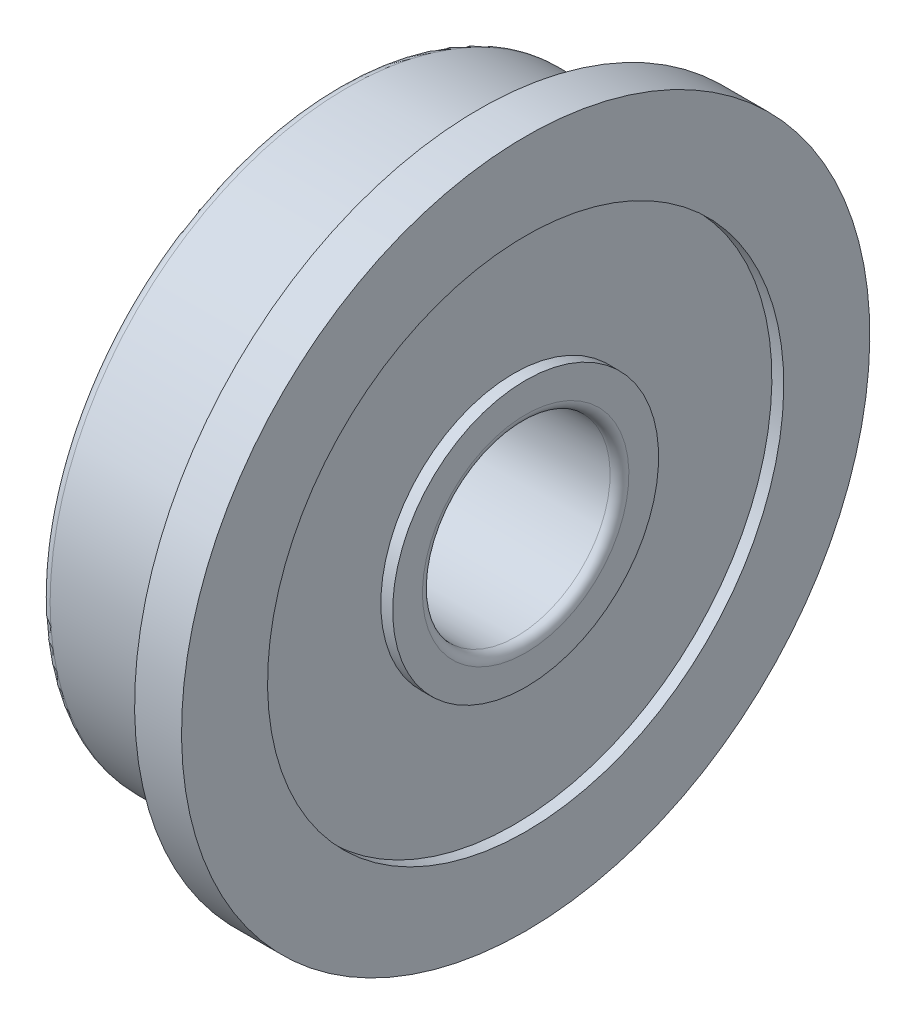
ISO-10303-21;
HEADER;
FILE_DESCRIPTION(('STEP AP214'),'2;1');
FILE_NAME('part.step','',(''),(''),'','','');
FILE_SCHEMA(('AUTOMOTIVE_DESIGN { 1 0 10303 214 1 1 1 1 }'));
ENDSEC;
DATA;
#1=APPLICATION_CONTEXT('core data for automotive mechanical design processes');
#2=APPLICATION_PROTOCOL_DEFINITION('international standard','automotive_design',2000,#1);
#3=PRODUCT_CONTEXT('',#1,'mechanical');
#4=PRODUCT('Part','Part','',(#3));
#5=PRODUCT_RELATED_PRODUCT_CATEGORY('part','',(#4));
#6=PRODUCT_DEFINITION_FORMATION('','',#4);
#7=PRODUCT_DEFINITION_CONTEXT('part definition',#1,'design');
#8=PRODUCT_DEFINITION('design','',#6,#7);
#9=PRODUCT_DEFINITION_SHAPE('','',#8);
#10=(LENGTH_UNIT() NAMED_UNIT(*) SI_UNIT(.MILLI.,.METRE.));
#11=(NAMED_UNIT(*) PLANE_ANGLE_UNIT() SI_UNIT($,.RADIAN.));
#12=(NAMED_UNIT(*) SI_UNIT($,.STERADIAN.) SOLID_ANGLE_UNIT());
#13=UNCERTAINTY_MEASURE_WITH_UNIT(LENGTH_MEASURE(1.E-05),#10,'distance_accuracy_value','');
#14=(GEOMETRIC_REPRESENTATION_CONTEXT(3) GLOBAL_UNCERTAINTY_ASSIGNED_CONTEXT((#13)) GLOBAL_UNIT_ASSIGNED_CONTEXT((#10,
#11,#12)) REPRESENTATION_CONTEXT('',''));
#15=CARTESIAN_POINT('',(0.,0.,0.));
#16=DIRECTION('',(0.,0.,1.));
#17=DIRECTION('',(1.,0.,0.));
#18=AXIS2_PLACEMENT_3D('',#15,#16,#17);
#19=CARTESIAN_POINT('',(-4.5,0.,0.));
#20=DIRECTION('',(-1.,0.,0.));
#21=DIRECTION('',(0.,-1.,0.));
#22=AXIS2_PLACEMENT_3D('',#19,#20,#21);
#23=CYLINDRICAL_SURFACE('',#22,11.);
#24=CARTESIAN_POINT('',(0.,0.,0.));
#25=DIRECTION('',(-1.,0.,0.));
#26=DIRECTION('',(0.,-1.,0.));
#27=AXIS2_PLACEMENT_3D('',#24,#25,#26);
#28=CIRCLE('',#27,11.);
#29=CARTESIAN_POINT('',(0.,-11.,0.));
#30=VERTEX_POINT('',#29);
#31=EDGE_CURVE('E61',#30,#30,#28,.T.);
#32=ORIENTED_EDGE('',*,*,#31,.F.);
#33=EDGE_LOOP('',(#32));
#34=FACE_BOUND('',#33,.T.);
#35=CARTESIAN_POINT('',(1.5,0.,0.));
#36=DIRECTION('',(-1.,0.,0.));
#37=DIRECTION('',(0.,-1.,0.));
#38=AXIS2_PLACEMENT_3D('',#35,#36,#37);
#39=CIRCLE('',#38,11.);
#40=CARTESIAN_POINT('',(1.5,-11.,0.));
#41=VERTEX_POINT('',#40);
#42=EDGE_CURVE('E94',#41,#41,#39,.T.);
#43=ORIENTED_EDGE('',*,*,#42,.T.);
#44=EDGE_LOOP('',(#43));
#45=FACE_BOUND('',#44,.T.);
#46=ADVANCED_FACE('F35',(#34,#45),#23,.T.);
#47=CARTESIAN_POINT('',(0.,9.7,0.));
#48=DIRECTION('',(1.,0.,0.));
#49=DIRECTION('',(0.,1.,0.));
#50=AXIS2_PLACEMENT_3D('',#47,#48,#49);
#51=PLANE('',#50);
#52=CARTESIAN_POINT('',(0.,0.,0.));
#53=DIRECTION('',(-1.,0.,0.));
#54=DIRECTION('',(0.,-1.,0.));
#55=AXIS2_PLACEMENT_3D('',#52,#53,#54);
#56=CIRCLE('',#55,9.7);
#57=CARTESIAN_POINT('',(0.,-9.7,0.));
#58=VERTEX_POINT('',#57);
#59=EDGE_CURVE('E64',#58,#58,#56,.T.);
#60=ORIENTED_EDGE('',*,*,#59,.F.);
#61=EDGE_LOOP('',(#60));
#62=FACE_BOUND('',#61,.T.);
#63=ORIENTED_EDGE('',*,*,#31,.T.);
#64=EDGE_LOOP('',(#63));
#65=FACE_BOUND('',#64,.T.);
#66=ADVANCED_FACE('F137',(#62,#65),#51,.F.);
#67=CARTESIAN_POINT('',(0.,0.,0.));
#68=DIRECTION('',(-1.,0.,0.));
#69=DIRECTION('',(0.,-1.,0.));
#70=AXIS2_PLACEMENT_3D('',#67,#68,#69);
#71=TOROIDAL_SURFACE('',#70,9.5,0.2);
#72=CARTESIAN_POINT('',(-0.200000000000001,0.,0.));
#73=DIRECTION('',(-1.,0.,0.));
#74=DIRECTION('',(0.,-1.,0.));
#75=AXIS2_PLACEMENT_3D('',#72,#73,#74);
#76=CIRCLE('',#75,9.5);
#77=CARTESIAN_POINT('',(-0.200000000000001,-9.5,0.));
#78=VERTEX_POINT('',#77);
#79=EDGE_CURVE('E67',#78,#78,#76,.T.);
#80=ORIENTED_EDGE('',*,*,#79,.F.);
#81=EDGE_LOOP('',(#80));
#82=FACE_BOUND('',#81,.T.);
#83=ORIENTED_EDGE('',*,*,#59,.T.);
#84=EDGE_LOOP('',(#83));
#85=FACE_BOUND('',#84,.T.);
#86=ADVANCED_FACE('F143',(#82,#85),#71,.F.);
#87=CARTESIAN_POINT('',(-4.5,0.,0.));
#88=DIRECTION('',(-1.,0.,0.));
#89=DIRECTION('',(0.,-1.,0.));
#90=AXIS2_PLACEMENT_3D('',#87,#88,#89);
#91=CYLINDRICAL_SURFACE('',#90,9.5);
#92=CARTESIAN_POINT('',(-4.2,0.,0.));
#93=DIRECTION('',(1.,0.,0.));
#94=DIRECTION('',(0.,1.,0.));
#95=AXIS2_PLACEMENT_3D('',#92,#93,#94);
#96=CIRCLE('',#95,9.5);
#97=CARTESIAN_POINT('',(-4.2,9.5,0.));
#98=VERTEX_POINT('',#97);
#99=EDGE_CURVE('E10',#98,#98,#96,.T.);
#100=ORIENTED_EDGE('',*,*,#99,.T.);
#101=EDGE_LOOP('',(#100));
#102=FACE_BOUND('',#101,.T.);
#103=ORIENTED_EDGE('',*,*,#79,.T.);
#104=EDGE_LOOP('',(#103));
#105=FACE_BOUND('',#104,.T.);
#106=ADVANCED_FACE('F187',(#102,#105),#91,.T.);
#107=CARTESIAN_POINT('',(-4.5,8.25,0.));
#108=DIRECTION('',(1.,0.,0.));
#109=DIRECTION('',(0.,1.,0.));
#110=AXIS2_PLACEMENT_3D('',#107,#108,#109);
#111=PLANE('',#110);
#112=CARTESIAN_POINT('',(-4.5,0.,0.));
#113=DIRECTION('',(1.,0.,0.));
#114=DIRECTION('',(0.,1.,0.));
#115=AXIS2_PLACEMENT_3D('',#112,#113,#114);
#116=CIRCLE('',#115,9.2);
#117=CARTESIAN_POINT('',(-4.5,9.2,0.));
#118=VERTEX_POINT('',#117);
#119=EDGE_CURVE('E42',#118,#118,#116,.F.);
#120=ORIENTED_EDGE('',*,*,#119,.T.);
#121=EDGE_LOOP('',(#120));
#122=FACE_BOUND('',#121,.T.);
#123=CARTESIAN_POINT('',(-4.5,0.,0.));
#124=DIRECTION('',(-1.,0.,0.));
#125=DIRECTION('',(0.,-1.,0.));
#126=AXIS2_PLACEMENT_3D('',#123,#124,#125);
#127=CIRCLE('',#126,8.25);
#128=CARTESIAN_POINT('',(-4.5,-8.25,0.));
#129=VERTEX_POINT('',#128);
#130=EDGE_CURVE('E70',#129,#129,#127,.T.);
#131=ORIENTED_EDGE('',*,*,#130,.F.);
#132=EDGE_LOOP('',(#131));
#133=FACE_BOUND('',#132,.T.);
#134=ADVANCED_FACE('F182',(#122,#133),#111,.F.);
#135=CARTESIAN_POINT('',(-4.5,0.,0.));
#136=DIRECTION('',(-1.,0.,0.));
#137=DIRECTION('',(0.,-1.,0.));
#138=AXIS2_PLACEMENT_3D('',#135,#136,#137);
#139=CYLINDRICAL_SURFACE('',#138,8.25);
#140=CARTESIAN_POINT('',(-4.12,0.,0.));
#141=DIRECTION('',(-1.,0.,0.));
#142=DIRECTION('',(0.,-1.,0.));
#143=AXIS2_PLACEMENT_3D('',#140,#141,#142);
#144=CIRCLE('',#143,8.25);
#145=CARTESIAN_POINT('',(-4.12,-8.25,0.));
#146=VERTEX_POINT('',#145);
#147=EDGE_CURVE('E73',#146,#146,#144,.T.);
#148=ORIENTED_EDGE('',*,*,#147,.F.);
#149=EDGE_LOOP('',(#148));
#150=FACE_BOUND('',#149,.T.);
#151=ORIENTED_EDGE('',*,*,#130,.T.);
#152=EDGE_LOOP('',(#151));
#153=FACE_BOUND('',#152,.T.);
#154=ADVANCED_FACE('F176',(#150,#153),#139,.F.);
#155=CARTESIAN_POINT('',(-4.12,8.25,0.));
#156=DIRECTION('',(1.,0.,0.));
#157=DIRECTION('',(0.,1.,0.));
#158=AXIS2_PLACEMENT_3D('',#155,#156,#157);
#159=PLANE('',#158);
#160=CARTESIAN_POINT('',(-4.12,0.,0.));
#161=DIRECTION('',(-1.,0.,0.));
#162=DIRECTION('',(0.,-1.,0.));
#163=AXIS2_PLACEMENT_3D('',#160,#161,#162);
#164=CIRCLE('',#163,4.25);
#165=CARTESIAN_POINT('',(-4.12,-4.25,0.));
#166=VERTEX_POINT('',#165);
#167=EDGE_CURVE('E76',#166,#166,#164,.T.);
#168=ORIENTED_EDGE('',*,*,#167,.F.);
#169=EDGE_LOOP('',(#168));
#170=FACE_BOUND('',#169,.T.);
#171=ORIENTED_EDGE('',*,*,#147,.T.);
#172=EDGE_LOOP('',(#171));
#173=FACE_BOUND('',#172,.T.);
#174=ADVANCED_FACE('F170',(#170,#173),#159,.F.);
#175=CARTESIAN_POINT('',(-4.5,0.,0.));
#176=DIRECTION('',(-1.,0.,0.));
#177=DIRECTION('',(0.,-1.,0.));
#178=AXIS2_PLACEMENT_3D('',#175,#176,#177);
#179=CYLINDRICAL_SURFACE('',#178,4.25);
#180=CARTESIAN_POINT('',(-4.5,0.,0.));
#181=DIRECTION('',(-1.,0.,0.));
#182=DIRECTION('',(0.,-1.,0.));
#183=AXIS2_PLACEMENT_3D('',#180,#181,#182);
#184=CIRCLE('',#183,4.25);
#185=CARTESIAN_POINT('',(-4.5,-4.25,0.));
#186=VERTEX_POINT('',#185);
#187=EDGE_CURVE('E79',#186,#186,#184,.T.);
#188=ORIENTED_EDGE('',*,*,#187,.F.);
#189=EDGE_LOOP('',(#188));
#190=FACE_BOUND('',#189,.T.);
#191=ORIENTED_EDGE('',*,*,#167,.T.);
#192=EDGE_LOOP('',(#191));
#193=FACE_BOUND('',#192,.T.);
#194=ADVANCED_FACE('F164',(#190,#193),#179,.T.);
#195=CARTESIAN_POINT('',(-4.5,3.,0.));
#196=DIRECTION('',(1.,0.,0.));
#197=DIRECTION('',(0.,1.,0.));
#198=AXIS2_PLACEMENT_3D('',#195,#196,#197);
#199=PLANE('',#198);
#200=CARTESIAN_POINT('',(-4.5,0.,0.));
#201=DIRECTION('',(1.,0.,0.));
#202=DIRECTION('',(0.,1.,0.));
#203=AXIS2_PLACEMENT_3D('',#200,#201,#202);
#204=CIRCLE('',#203,3.3);
#205=CARTESIAN_POINT('',(-4.5,3.3,0.));
#206=VERTEX_POINT('',#205);
#207=EDGE_CURVE('E46',#206,#206,#204,.T.);
#208=ORIENTED_EDGE('',*,*,#207,.T.);
#209=EDGE_LOOP('',(#208));
#210=FACE_BOUND('',#209,.T.);
#211=ORIENTED_EDGE('',*,*,#187,.T.);
#212=EDGE_LOOP('',(#211));
#213=FACE_BOUND('',#212,.T.);
#214=ADVANCED_FACE('F133',(#210,#213),#199,.F.);
#215=CARTESIAN_POINT('',(-4.5,0.,0.));
#216=DIRECTION('',(-1.,0.,0.));
#217=DIRECTION('',(0.,-1.,0.));
#218=AXIS2_PLACEMENT_3D('',#215,#216,#217);
#219=CYLINDRICAL_SURFACE('',#218,3.);
#220=CARTESIAN_POINT('',(1.2,0.,0.));
#221=DIRECTION('',(-1.,0.,0.));
#222=DIRECTION('',(0.,-1.,0.));
#223=AXIS2_PLACEMENT_3D('',#220,#221,#222);
#224=CIRCLE('',#223,3.);
#225=CARTESIAN_POINT('',(1.2,-3.,0.));
#226=VERTEX_POINT('',#225);
#227=EDGE_CURVE('E50',#226,#226,#224,.F.);
#228=ORIENTED_EDGE('',*,*,#227,.T.);
#229=EDGE_LOOP('',(#228));
#230=FACE_BOUND('',#229,.T.);
#231=CARTESIAN_POINT('',(-4.2,0.,0.));
#232=DIRECTION('',(1.,0.,0.));
#233=DIRECTION('',(0.,1.,0.));
#234=AXIS2_PLACEMENT_3D('',#231,#232,#233);
#235=CIRCLE('',#234,3.);
#236=CARTESIAN_POINT('',(-4.2,3.,0.));
#237=VERTEX_POINT('',#236);
#238=EDGE_CURVE('E55',#237,#237,#235,.F.);
#239=ORIENTED_EDGE('',*,*,#238,.T.);
#240=EDGE_LOOP('',(#239));
#241=FACE_BOUND('',#240,.T.);
#242=ADVANCED_FACE('F126',(#230,#241),#219,.F.);
#243=CARTESIAN_POINT('',(1.5,4.25,0.));
#244=DIRECTION('',(-1.,0.,0.));
#245=DIRECTION('',(0.,-1.,0.));
#246=AXIS2_PLACEMENT_3D('',#243,#244,#245);
#247=PLANE('',#246);
#248=CARTESIAN_POINT('',(1.5,0.,0.));
#249=DIRECTION('',(-1.,0.,0.));
#250=DIRECTION('',(0.,-1.,0.));
#251=AXIS2_PLACEMENT_3D('',#248,#249,#250);
#252=CIRCLE('',#251,3.3);
#253=CARTESIAN_POINT('',(1.5,-3.3,0.));
#254=VERTEX_POINT('',#253);
#255=EDGE_CURVE('E58',#254,#254,#252,.T.);
#256=ORIENTED_EDGE('',*,*,#255,.T.);
#257=EDGE_LOOP('',(#256));
#258=FACE_BOUND('',#257,.T.);
#259=CARTESIAN_POINT('',(1.5,0.,0.));
#260=DIRECTION('',(-1.,0.,0.));
#261=DIRECTION('',(0.,-1.,0.));
#262=AXIS2_PLACEMENT_3D('',#259,#260,#261);
#263=CIRCLE('',#262,4.25);
#264=CARTESIAN_POINT('',(1.5,-4.25,0.));
#265=VERTEX_POINT('',#264);
#266=EDGE_CURVE('E82',#265,#265,#263,.T.);
#267=ORIENTED_EDGE('',*,*,#266,.F.);
#268=EDGE_LOOP('',(#267));
#269=FACE_BOUND('',#268,.T.);
#270=ADVANCED_FACE('F121',(#258,#269),#247,.F.);
#271=CARTESIAN_POINT('',(-4.5,0.,0.));
#272=DIRECTION('',(-1.,0.,0.));
#273=DIRECTION('',(0.,-1.,0.));
#274=AXIS2_PLACEMENT_3D('',#271,#272,#273);
#275=CYLINDRICAL_SURFACE('',#274,4.25);
#276=CARTESIAN_POINT('',(1.12,0.,0.));
#277=DIRECTION('',(-1.,0.,0.));
#278=DIRECTION('',(0.,-1.,0.));
#279=AXIS2_PLACEMENT_3D('',#276,#277,#278);
#280=CIRCLE('',#279,4.25);
#281=CARTESIAN_POINT('',(1.12,-4.25,0.));
#282=VERTEX_POINT('',#281);
#283=EDGE_CURVE('E85',#282,#282,#280,.T.);
#284=ORIENTED_EDGE('',*,*,#283,.F.);
#285=EDGE_LOOP('',(#284));
#286=FACE_BOUND('',#285,.T.);
#287=ORIENTED_EDGE('',*,*,#266,.T.);
#288=EDGE_LOOP('',(#287));
#289=FACE_BOUND('',#288,.T.);
#290=ADVANCED_FACE('F115',(#286,#289),#275,.T.);
#291=CARTESIAN_POINT('',(1.12,8.25,0.));
#292=DIRECTION('',(-1.,0.,0.));
#293=DIRECTION('',(0.,-1.,0.));
#294=AXIS2_PLACEMENT_3D('',#291,#292,#293);
#295=PLANE('',#294);
#296=CARTESIAN_POINT('',(1.12,0.,0.));
#297=DIRECTION('',(-1.,0.,0.));
#298=DIRECTION('',(0.,-1.,0.));
#299=AXIS2_PLACEMENT_3D('',#296,#297,#298);
#300=CIRCLE('',#299,8.25);
#301=CARTESIAN_POINT('',(1.12,-8.25,0.));
#302=VERTEX_POINT('',#301);
#303=EDGE_CURVE('E88',#302,#302,#300,.T.);
#304=ORIENTED_EDGE('',*,*,#303,.F.);
#305=EDGE_LOOP('',(#304));
#306=FACE_BOUND('',#305,.T.);
#307=ORIENTED_EDGE('',*,*,#283,.T.);
#308=EDGE_LOOP('',(#307));
#309=FACE_BOUND('',#308,.T.);
#310=ADVANCED_FACE('F109',(#306,#309),#295,.F.);
#311=CARTESIAN_POINT('',(-4.5,0.,0.));
#312=DIRECTION('',(-1.,0.,0.));
#313=DIRECTION('',(0.,-1.,0.));
#314=AXIS2_PLACEMENT_3D('',#311,#312,#313);
#315=CYLINDRICAL_SURFACE('',#314,8.25);
#316=CARTESIAN_POINT('',(1.5,0.,0.));
#317=DIRECTION('',(-1.,0.,0.));
#318=DIRECTION('',(0.,-1.,0.));
#319=AXIS2_PLACEMENT_3D('',#316,#317,#318);
#320=CIRCLE('',#319,8.25);
#321=CARTESIAN_POINT('',(1.5,-8.25,0.));
#322=VERTEX_POINT('',#321);
#323=EDGE_CURVE('E91',#322,#322,#320,.T.);
#324=ORIENTED_EDGE('',*,*,#323,.F.);
#325=EDGE_LOOP('',(#324));
#326=FACE_BOUND('',#325,.T.);
#327=ORIENTED_EDGE('',*,*,#303,.T.);
#328=EDGE_LOOP('',(#327));
#329=FACE_BOUND('',#328,.T.);
#330=ADVANCED_FACE('F103',(#326,#329),#315,.F.);
#331=CARTESIAN_POINT('',(1.5,11.,0.));
#332=DIRECTION('',(-1.,0.,0.));
#333=DIRECTION('',(0.,-1.,0.));
#334=AXIS2_PLACEMENT_3D('',#331,#332,#333);
#335=PLANE('',#334);
#336=ORIENTED_EDGE('',*,*,#42,.F.);
#337=EDGE_LOOP('',(#336));
#338=FACE_BOUND('',#337,.T.);
#339=ORIENTED_EDGE('',*,*,#323,.T.);
#340=EDGE_LOOP('',(#339));
#341=FACE_BOUND('',#340,.T.);
#342=ADVANCED_FACE('F99',(#338,#341),#335,.F.);
#343=CARTESIAN_POINT('',(1.2,0.,0.));
#344=DIRECTION('',(-1.,0.,0.));
#345=DIRECTION('',(0.,-1.,0.));
#346=AXIS2_PLACEMENT_3D('',#343,#344,#345);
#347=TOROIDAL_SURFACE('',#346,3.3,0.3);
#348=ORIENTED_EDGE('',*,*,#227,.F.);
#349=EDGE_LOOP('',(#348));
#350=FACE_BOUND('',#349,.T.);
#351=ORIENTED_EDGE('',*,*,#255,.F.);
#352=EDGE_LOOP('',(#351));
#353=FACE_BOUND('',#352,.T.);
#354=ADVANCED_FACE('F102',(#350,#353),#347,.T.);
#355=CARTESIAN_POINT('',(-4.2,0.,0.));
#356=DIRECTION('',(1.,0.,0.));
#357=DIRECTION('',(0.,1.,0.));
#358=AXIS2_PLACEMENT_3D('',#355,#356,#357);
#359=TOROIDAL_SURFACE('',#358,3.3,0.3);
#360=ORIENTED_EDGE('',*,*,#207,.F.);
#361=EDGE_LOOP('',(#360));
#362=FACE_BOUND('',#361,.T.);
#363=ORIENTED_EDGE('',*,*,#238,.F.);
#364=EDGE_LOOP('',(#363));
#365=FACE_BOUND('',#364,.T.);
#366=ADVANCED_FACE('F149',(#362,#365),#359,.T.);
#367=CARTESIAN_POINT('',(-4.2,0.,0.));
#368=DIRECTION('',(1.,0.,0.));
#369=DIRECTION('',(0.,1.,0.));
#370=AXIS2_PLACEMENT_3D('',#367,#368,#369);
#371=TOROIDAL_SURFACE('',#370,9.2,0.3);
#372=ORIENTED_EDGE('',*,*,#99,.F.);
#373=EDGE_LOOP('',(#372));
#374=FACE_BOUND('',#373,.T.);
#375=ORIENTED_EDGE('',*,*,#119,.F.);
#376=EDGE_LOOP('',(#375));
#377=FACE_BOUND('',#376,.T.);
#378=ADVANCED_FACE('F37',(#374,#377),#371,.T.);
#379=CLOSED_SHELL('',(#46,#66,#86,#106,#134,#154,#174,#194,#214,#242,#270,#290,#310,#330,#342,
#354,#366,#378));
#380=MANIFOLD_SOLID_BREP('B2',#379);
#381=ADVANCED_BREP_SHAPE_REPRESENTATION('',(#18,#380),#14);
#382=SHAPE_DEFINITION_REPRESENTATION(#9,#381);
ENDSEC;
END-ISO-10303-21;
